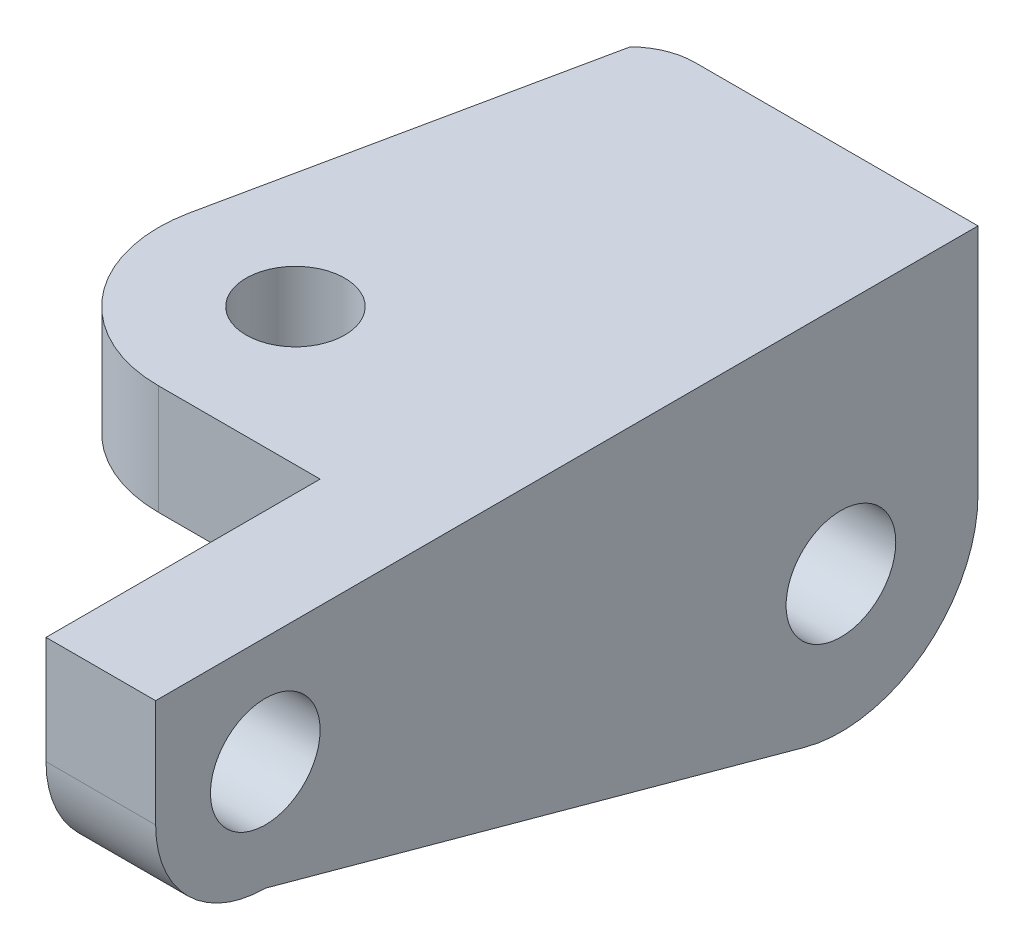
ISO-10303-21;
HEADER;
FILE_DESCRIPTION(('STEP AP214'),'2;1');
FILE_NAME('part.step','',(''),(''),'','','');
FILE_SCHEMA(('AUTOMOTIVE_DESIGN { 1 0 10303 214 1 1 1 1 }'));
ENDSEC;
DATA;
#1=APPLICATION_CONTEXT('core data for automotive mechanical design processes');
#2=APPLICATION_PROTOCOL_DEFINITION('international standard','automotive_design',2000,#1);
#3=PRODUCT_CONTEXT('',#1,'mechanical');
#4=PRODUCT('Part','Part','',(#3));
#5=PRODUCT_RELATED_PRODUCT_CATEGORY('part','',(#4));
#6=PRODUCT_DEFINITION_FORMATION('','',#4);
#7=PRODUCT_DEFINITION_CONTEXT('part definition',#1,'design');
#8=PRODUCT_DEFINITION('design','',#6,#7);
#9=PRODUCT_DEFINITION_SHAPE('','',#8);
#10=(LENGTH_UNIT() NAMED_UNIT(*) SI_UNIT(.MILLI.,.METRE.));
#11=(NAMED_UNIT(*) PLANE_ANGLE_UNIT() SI_UNIT($,.RADIAN.));
#12=(NAMED_UNIT(*) SI_UNIT($,.STERADIAN.) SOLID_ANGLE_UNIT());
#13=UNCERTAINTY_MEASURE_WITH_UNIT(LENGTH_MEASURE(1.E-05),#10,'distance_accuracy_value','');
#14=(GEOMETRIC_REPRESENTATION_CONTEXT(3) GLOBAL_UNCERTAINTY_ASSIGNED_CONTEXT((#13)) GLOBAL_UNIT_ASSIGNED_CONTEXT((#10,
#11,#12)) REPRESENTATION_CONTEXT('',''));
#15=CARTESIAN_POINT('',(0.,0.,0.));
#16=DIRECTION('',(0.,0.,1.));
#17=DIRECTION('',(1.,0.,0.));
#18=AXIS2_PLACEMENT_3D('',#15,#16,#17);
#19=CARTESIAN_POINT('',(0.,-19.63,-20.));
#20=DIRECTION('',(1.,0.,0.));
#21=DIRECTION('',(0.,0.,-1.));
#22=AXIS2_PLACEMENT_3D('',#19,#20,#21);
#23=PLANE('',#22);
#24=CARTESIAN_POINT('',(0.,-42.46,-125.));
#25=DIRECTION('',(1.,0.,0.));
#26=DIRECTION('',(0.,0.,-1.));
#27=AXIS2_PLACEMENT_3D('',#24,#25,#26);
#28=CIRCLE('',#27,10.);
#29=CARTESIAN_POINT('',(0.,-42.46,-135.));
#30=VERTEX_POINT('',#29);
#31=EDGE_CURVE('E173',#30,#30,#28,.T.);
#32=ORIENTED_EDGE('',*,*,#31,.T.);
#33=EDGE_LOOP('',(#32));
#34=FACE_BOUND('',#33,.T.);
#35=CARTESIAN_POINT('',(0.,-19.63,-20.));
#36=DIRECTION('',(1.,0.,0.));
#37=DIRECTION('',(0.,0.,-1.));
#38=AXIS2_PLACEMENT_3D('',#35,#36,#37);
#39=CIRCLE('',#38,10.);
#40=CARTESIAN_POINT('',(0.,-19.63,-30.));
#41=VERTEX_POINT('',#40);
#42=EDGE_CURVE('E167',#41,#41,#39,.T.);
#43=ORIENTED_EDGE('',*,*,#42,.T.);
#44=EDGE_LOOP('',(#43));
#45=FACE_BOUND('',#44,.T.);
#46=DIRECTION('',(0.,1.,0.));
#47=VECTOR('',#46,1.);
#48=CARTESIAN_POINT('',(0.,-20.,-50.));
#49=LINE('',#48,#47);
#50=CARTESIAN_POINT('',(0.,-20.,-50.));
#51=VERTEX_POINT('',#50);
#52=CARTESIAN_POINT('',(0.,0.,-50.));
#53=VERTEX_POINT('',#52);
#54=EDGE_CURVE('E176',#51,#53,#49,.T.);
#55=ORIENTED_EDGE('',*,*,#54,.F.);
#56=DIRECTION('',(0.,0.,-1.));
#57=VECTOR('',#56,1.);
#58=CARTESIAN_POINT('',(0.,-20.,-50.));
#59=LINE('',#58,#57);
#60=CARTESIAN_POINT('',(0.,-20.,-150.));
#61=VERTEX_POINT('',#60);
#62=EDGE_CURVE('E150',#51,#61,#59,.T.);
#63=ORIENTED_EDGE('',*,*,#62,.T.);
#64=DIRECTION('',(0.,1.,0.));
#65=VECTOR('',#64,1.);
#66=CARTESIAN_POINT('',(0.,-42.46,-150.));
#67=LINE('',#66,#65);
#68=CARTESIAN_POINT('',(0.,-42.46,-150.));
#69=VERTEX_POINT('',#68);
#70=EDGE_CURVE('E134',#69,#61,#67,.T.);
#71=ORIENTED_EDGE('',*,*,#70,.F.);
#72=CARTESIAN_POINT('',(0.,-42.46,-125.));
#73=DIRECTION('',(1.,0.,0.));
#74=DIRECTION('',(0.,0.,-1.));
#75=AXIS2_PLACEMENT_3D('',#72,#73,#74);
#76=CIRCLE('',#75,25.);
#77=CARTESIAN_POINT('',(0.,-66.5724458933428,-118.397731220208));
#78=VERTEX_POINT('',#77);
#79=EDGE_CURVE('E82',#78,#69,#76,.T.);
#80=ORIENTED_EDGE('',*,*,#79,.F.);
#81=DIRECTION('',(0.,-0.26409075119168,-0.964497835733712));
#82=VECTOR('',#81,1.);
#83=CARTESIAN_POINT('',(0.,-39.63,-20.));
#84=LINE('',#83,#82);
#85=CARTESIAN_POINT('',(0.,-39.63,-20.));
#86=VERTEX_POINT('',#85);
#87=EDGE_CURVE('E115',#86,#78,#84,.T.);
#88=ORIENTED_EDGE('',*,*,#87,.F.);
#89=CARTESIAN_POINT('',(0.,-19.63,-20.));
#90=DIRECTION('',(1.,0.,0.));
#91=DIRECTION('',(0.,0.,-1.));
#92=AXIS2_PLACEMENT_3D('',#89,#90,#91);
#93=CIRCLE('',#92,20.);
#94=CARTESIAN_POINT('',(0.,-19.63,0.));
#95=VERTEX_POINT('',#94);
#96=EDGE_CURVE('E130',#95,#86,#93,.T.);
#97=ORIENTED_EDGE('',*,*,#96,.F.);
#98=DIRECTION('',(0.,-1.,0.));
#99=VECTOR('',#98,1.);
#100=CARTESIAN_POINT('',(0.,0.,0.));
#101=LINE('',#100,#99);
#102=CARTESIAN_POINT('',(0.,0.,0.));
#103=VERTEX_POINT('',#102);
#104=EDGE_CURVE('E127',#103,#95,#101,.T.);
#105=ORIENTED_EDGE('',*,*,#104,.F.);
#106=DIRECTION('',(0.,0.,1.));
#107=VECTOR('',#106,1.);
#108=CARTESIAN_POINT('',(0.,0.,-150.));
#109=LINE('',#108,#107);
#110=EDGE_CURVE('E125',#53,#103,#109,.T.);
#111=ORIENTED_EDGE('',*,*,#110,.F.);
#112=EDGE_LOOP('',(#55,#63,#71,#80,#88,#97,#105,#111));
#113=FACE_BOUND('',#112,.T.);
#114=ADVANCED_FACE('F33',(#34,#45,#113),#23,.F.);
#115=CARTESIAN_POINT('',(20.,-19.63,-20.));
#116=DIRECTION('',(1.,0.,0.));
#117=DIRECTION('',(0.,0.,-1.));
#118=AXIS2_PLACEMENT_3D('',#115,#116,#117);
#119=PLANE('',#118);
#120=CARTESIAN_POINT('',(20.,-19.63,-20.));
#121=DIRECTION('',(1.,0.,0.));
#122=DIRECTION('',(0.,0.,-1.));
#123=AXIS2_PLACEMENT_3D('',#120,#121,#122);
#124=CIRCLE('',#123,10.);
#125=CARTESIAN_POINT('',(20.,-19.63,-30.));
#126=VERTEX_POINT('',#125);
#127=EDGE_CURVE('E128',#126,#126,#124,.T.);
#128=ORIENTED_EDGE('',*,*,#127,.F.);
#129=EDGE_LOOP('',(#128));
#130=FACE_BOUND('',#129,.T.);
#131=DIRECTION('',(0.,0.,1.));
#132=VECTOR('',#131,1.);
#133=CARTESIAN_POINT('',(20.,0.,-150.));
#134=LINE('',#133,#132);
#135=CARTESIAN_POINT('',(20.,0.,-150.));
#136=VERTEX_POINT('',#135);
#137=CARTESIAN_POINT('',(20.,0.,0.));
#138=VERTEX_POINT('',#137);
#139=EDGE_CURVE('E137',#136,#138,#134,.T.);
#140=ORIENTED_EDGE('',*,*,#139,.T.);
#141=DIRECTION('',(0.,-1.,0.));
#142=VECTOR('',#141,1.);
#143=CARTESIAN_POINT('',(20.,0.,0.));
#144=LINE('',#143,#142);
#145=CARTESIAN_POINT('',(20.,-19.63,0.));
#146=VERTEX_POINT('',#145);
#147=EDGE_CURVE('E90',#138,#146,#144,.T.);
#148=ORIENTED_EDGE('',*,*,#147,.T.);
#149=CARTESIAN_POINT('',(20.,-19.63,-20.));
#150=DIRECTION('',(1.,0.,0.));
#151=DIRECTION('',(0.,0.,-1.));
#152=AXIS2_PLACEMENT_3D('',#149,#150,#151);
#153=CIRCLE('',#152,20.);
#154=CARTESIAN_POINT('',(20.,-39.63,-20.));
#155=VERTEX_POINT('',#154);
#156=EDGE_CURVE('E107',#146,#155,#153,.T.);
#157=ORIENTED_EDGE('',*,*,#156,.T.);
#158=DIRECTION('',(0.,-0.26409075119168,-0.964497835733712));
#159=VECTOR('',#158,1.);
#160=CARTESIAN_POINT('',(20.,-39.63,-20.));
#161=LINE('',#160,#159);
#162=CARTESIAN_POINT('',(20.,-66.5724458933428,-118.397731220208));
#163=VERTEX_POINT('',#162);
#164=EDGE_CURVE('E100',#155,#163,#161,.T.);
#165=ORIENTED_EDGE('',*,*,#164,.T.);
#166=CARTESIAN_POINT('',(20.,-42.46,-125.));
#167=DIRECTION('',(1.,0.,0.));
#168=DIRECTION('',(0.,0.,-1.));
#169=AXIS2_PLACEMENT_3D('',#166,#167,#168);
#170=CIRCLE('',#169,25.);
#171=CARTESIAN_POINT('',(20.,-42.46,-150.));
#172=VERTEX_POINT('',#171);
#173=EDGE_CURVE('E105',#163,#172,#170,.T.);
#174=ORIENTED_EDGE('',*,*,#173,.T.);
#175=DIRECTION('',(0.,1.,0.));
#176=VECTOR('',#175,1.);
#177=CARTESIAN_POINT('',(20.,-42.46,-150.));
#178=LINE('',#177,#176);
#179=EDGE_CURVE('E57',#172,#136,#178,.T.);
#180=ORIENTED_EDGE('',*,*,#179,.T.);
#181=EDGE_LOOP('',(#140,#148,#157,#165,#174,#180));
#182=FACE_BOUND('',#181,.T.);
#183=CARTESIAN_POINT('',(20.,-42.46,-125.));
#184=DIRECTION('',(1.,0.,0.));
#185=DIRECTION('',(0.,0.,-1.));
#186=AXIS2_PLACEMENT_3D('',#183,#184,#185);
#187=CIRCLE('',#186,10.);
#188=CARTESIAN_POINT('',(20.,-42.46,-135.));
#189=VERTEX_POINT('',#188);
#190=EDGE_CURVE('E170',#189,#189,#187,.T.);
#191=ORIENTED_EDGE('',*,*,#190,.F.);
#192=EDGE_LOOP('',(#191));
#193=FACE_BOUND('',#192,.T.);
#194=ADVANCED_FACE('F102',(#130,#182,#193),#119,.T.);
#195=CARTESIAN_POINT('',(20.,0.,-150.));
#196=DIRECTION('',(0.,-1.,0.));
#197=DIRECTION('',(0.,0.,-1.));
#198=AXIS2_PLACEMENT_3D('',#195,#196,#197);
#199=PLANE('',#198);
#200=DIRECTION('',(-1.,0.,0.));
#201=VECTOR('',#200,1.);
#202=CARTESIAN_POINT('',(20.,0.,-150.));
#203=LINE('',#202,#201);
#204=CARTESIAN_POINT('',(-31.593900405197,0.,-150.));
#205=VERTEX_POINT('',#204);
#206=EDGE_CURVE('E121',#136,#205,#203,.T.);
#207=ORIENTED_EDGE('',*,*,#206,.T.);
#208=CARTESIAN_POINT('',(-31.593900405197,0.,-138.));
#209=DIRECTION('',(0.,1.,0.));
#210=DIRECTION('',(0.,0.,1.));
#211=AXIS2_PLACEMENT_3D('',#208,#209,#210);
#212=CIRCLE('',#211,12.);
#213=CARTESIAN_POINT('',(-40.,0.,-146.563731056161));
#214=VERTEX_POINT('',#213);
#215=EDGE_CURVE('E201',#205,#214,#212,.T.);
#216=ORIENTED_EDGE('',*,*,#215,.T.);
#217=DIRECTION('',(-0.205755971685466,0.,0.978603331343078));
#218=VECTOR('',#217,1.);
#219=CARTESIAN_POINT('',(-40.,0.,-146.563731056161));
#220=LINE('',#219,#218);
#221=CARTESIAN_POINT('',(-53.965083283577,0.,-80.1438992921366));
#222=VERTEX_POINT('',#221);
#223=EDGE_CURVE('E198',#214,#222,#220,.T.);
#224=ORIENTED_EDGE('',*,*,#223,.T.);
#225=CARTESIAN_POINT('',(-29.5,0.,-75.));
#226=DIRECTION('',(0.,1.,0.));
#227=DIRECTION('',(0.,0.,1.));
#228=AXIS2_PLACEMENT_3D('',#225,#226,#227);
#229=CIRCLE('',#228,25.);
#230=CARTESIAN_POINT('',(-29.5,0.,-50.));
#231=VERTEX_POINT('',#230);
#232=EDGE_CURVE('E195',#222,#231,#229,.T.);
#233=ORIENTED_EDGE('',*,*,#232,.T.);
#234=DIRECTION('',(1.,0.,0.));
#235=VECTOR('',#234,1.);
#236=CARTESIAN_POINT('',(-29.5,0.,-50.));
#237=LINE('',#236,#235);
#238=EDGE_CURVE('E192',#231,#53,#237,.T.);
#239=ORIENTED_EDGE('',*,*,#238,.T.);
#240=ORIENTED_EDGE('',*,*,#110,.T.);
#241=DIRECTION('',(-1.,0.,0.));
#242=VECTOR('',#241,1.);
#243=CARTESIAN_POINT('',(20.,0.,0.));
#244=LINE('',#243,#242);
#245=EDGE_CURVE('E11',#138,#103,#244,.T.);
#246=ORIENTED_EDGE('',*,*,#245,.F.);
#247=ORIENTED_EDGE('',*,*,#139,.F.);
#248=EDGE_LOOP('',(#207,#216,#224,#233,#239,#240,#246,#247));
#249=FACE_BOUND('',#248,.T.);
#250=CARTESIAN_POINT('',(-29.5,0.,-75.));
#251=DIRECTION('',(0.,1.,0.));
#252=DIRECTION('',(0.,0.,1.));
#253=AXIS2_PLACEMENT_3D('',#250,#251,#252);
#254=CIRCLE('',#253,9.);
#255=CARTESIAN_POINT('',(-29.5,0.,-66.));
#256=VERTEX_POINT('',#255);
#257=EDGE_CURVE('E217',#256,#256,#254,.T.);
#258=ORIENTED_EDGE('',*,*,#257,.F.);
#259=EDGE_LOOP('',(#258));
#260=FACE_BOUND('',#259,.T.);
#261=ADVANCED_FACE('F35',(#249,#260),#199,.F.);
#262=CARTESIAN_POINT('',(20.,0.,0.));
#263=DIRECTION('',(0.,0.,-1.));
#264=DIRECTION('',(0.,1.,0.));
#265=AXIS2_PLACEMENT_3D('',#262,#263,#264);
#266=PLANE('',#265);
#267=ORIENTED_EDGE('',*,*,#104,.T.);
#268=DIRECTION('',(-1.,0.,0.));
#269=VECTOR('',#268,1.);
#270=CARTESIAN_POINT('',(20.,-19.63,0.));
#271=LINE('',#270,#269);
#272=EDGE_CURVE('E41',#146,#95,#271,.T.);
#273=ORIENTED_EDGE('',*,*,#272,.F.);
#274=ORIENTED_EDGE('',*,*,#147,.F.);
#275=ORIENTED_EDGE('',*,*,#245,.T.);
#276=EDGE_LOOP('',(#267,#273,#274,#275));
#277=FACE_BOUND('',#276,.T.);
#278=ADVANCED_FACE('F231',(#277),#266,.F.);
#279=CARTESIAN_POINT('',(20.,-19.63,-20.));
#280=DIRECTION('',(-1.,0.,0.));
#281=DIRECTION('',(0.,0.,1.));
#282=AXIS2_PLACEMENT_3D('',#279,#280,#281);
#283=CYLINDRICAL_SURFACE('',#282,20.);
#284=ORIENTED_EDGE('',*,*,#96,.T.);
#285=DIRECTION('',(-1.,0.,0.));
#286=VECTOR('',#285,1.);
#287=CARTESIAN_POINT('',(20.,-39.63,-20.));
#288=LINE('',#287,#286);
#289=EDGE_CURVE('E116',#155,#86,#288,.T.);
#290=ORIENTED_EDGE('',*,*,#289,.F.);
#291=ORIENTED_EDGE('',*,*,#156,.F.);
#292=ORIENTED_EDGE('',*,*,#272,.T.);
#293=EDGE_LOOP('',(#284,#290,#291,#292));
#294=FACE_BOUND('',#293,.T.);
#295=ADVANCED_FACE('F144',(#294),#283,.T.);
#296=CARTESIAN_POINT('',(20.,-39.63,-20.));
#297=DIRECTION('',(0.,0.964497835733712,-0.26409075119168));
#298=DIRECTION('',(0.,0.26409075119168,0.964497835733712));
#299=AXIS2_PLACEMENT_3D('',#296,#297,#298);
#300=PLANE('',#299);
#301=ORIENTED_EDGE('',*,*,#87,.T.);
#302=DIRECTION('',(-1.,0.,0.));
#303=VECTOR('',#302,1.);
#304=CARTESIAN_POINT('',(20.,-66.5724458933428,-118.397731220208));
#305=LINE('',#304,#303);
#306=EDGE_CURVE('E112',#163,#78,#305,.T.);
#307=ORIENTED_EDGE('',*,*,#306,.F.);
#308=ORIENTED_EDGE('',*,*,#164,.F.);
#309=ORIENTED_EDGE('',*,*,#289,.T.);
#310=EDGE_LOOP('',(#301,#307,#308,#309));
#311=FACE_BOUND('',#310,.T.);
#312=ADVANCED_FACE('F113',(#311),#300,.F.);
#313=CARTESIAN_POINT('',(20.,-42.46,-125.));
#314=DIRECTION('',(-1.,0.,0.));
#315=DIRECTION('',(0.,0.,1.));
#316=AXIS2_PLACEMENT_3D('',#313,#314,#315);
#317=CYLINDRICAL_SURFACE('',#316,25.);
#318=ORIENTED_EDGE('',*,*,#79,.T.);
#319=DIRECTION('',(-1.,0.,0.));
#320=VECTOR('',#319,1.);
#321=CARTESIAN_POINT('',(20.,-42.46,-150.));
#322=LINE('',#321,#320);
#323=EDGE_CURVE('E117',#172,#69,#322,.T.);
#324=ORIENTED_EDGE('',*,*,#323,.F.);
#325=ORIENTED_EDGE('',*,*,#173,.F.);
#326=ORIENTED_EDGE('',*,*,#306,.T.);
#327=EDGE_LOOP('',(#318,#324,#325,#326));
#328=FACE_BOUND('',#327,.T.);
#329=ADVANCED_FACE('F119',(#328),#317,.T.);
#330=CARTESIAN_POINT('',(20.,-42.46,-150.));
#331=DIRECTION('',(0.,0.,1.));
#332=DIRECTION('',(1.,0.,0.));
#333=AXIS2_PLACEMENT_3D('',#330,#331,#332);
#334=PLANE('',#333);
#335=ORIENTED_EDGE('',*,*,#70,.T.);
#336=DIRECTION('',(-1.,0.,0.));
#337=VECTOR('',#336,1.);
#338=CARTESIAN_POINT('',(0.,-20.,-150.));
#339=LINE('',#338,#337);
#340=CARTESIAN_POINT('',(-31.593900405197,-20.,-150.));
#341=VERTEX_POINT('',#340);
#342=EDGE_CURVE('E48',#61,#341,#339,.T.);
#343=ORIENTED_EDGE('',*,*,#342,.T.);
#344=DIRECTION('',(0.,1.,0.));
#345=VECTOR('',#344,1.);
#346=CARTESIAN_POINT('',(-31.593900405197,-20.,-150.));
#347=LINE('',#346,#345);
#348=EDGE_CURVE('E158',#341,#205,#347,.T.);
#349=ORIENTED_EDGE('',*,*,#348,.T.);
#350=ORIENTED_EDGE('',*,*,#206,.F.);
#351=ORIENTED_EDGE('',*,*,#179,.F.);
#352=ORIENTED_EDGE('',*,*,#323,.T.);
#353=EDGE_LOOP('',(#335,#343,#349,#350,#351,#352));
#354=FACE_BOUND('',#353,.T.);
#355=ADVANCED_FACE('F152',(#354),#334,.F.);
#356=CARTESIAN_POINT('',(20.,-19.63,-20.));
#357=DIRECTION('',(-1.,0.,0.));
#358=DIRECTION('',(0.,0.,1.));
#359=AXIS2_PLACEMENT_3D('',#356,#357,#358);
#360=CYLINDRICAL_SURFACE('',#359,10.);
#361=ORIENTED_EDGE('',*,*,#127,.T.);
#362=EDGE_LOOP('',(#361));
#363=FACE_BOUND('',#362,.T.);
#364=ORIENTED_EDGE('',*,*,#42,.F.);
#365=EDGE_LOOP('',(#364));
#366=FACE_BOUND('',#365,.T.);
#367=ADVANCED_FACE('F248',(#363,#366),#360,.F.);
#368=CARTESIAN_POINT('',(20.,-42.46,-125.));
#369=DIRECTION('',(-1.,0.,0.));
#370=DIRECTION('',(0.,0.,1.));
#371=AXIS2_PLACEMENT_3D('',#368,#369,#370);
#372=CYLINDRICAL_SURFACE('',#371,10.);
#373=ORIENTED_EDGE('',*,*,#190,.T.);
#374=EDGE_LOOP('',(#373));
#375=FACE_BOUND('',#374,.T.);
#376=ORIENTED_EDGE('',*,*,#31,.F.);
#377=EDGE_LOOP('',(#376));
#378=FACE_BOUND('',#377,.T.);
#379=ADVANCED_FACE('F277',(#375,#378),#372,.F.);
#380=CARTESIAN_POINT('',(-29.5,-20.,-50.));
#381=DIRECTION('',(0.,0.,1.));
#382=DIRECTION('',(1.,0.,0.));
#383=AXIS2_PLACEMENT_3D('',#380,#381,#382);
#384=PLANE('',#383);
#385=ORIENTED_EDGE('',*,*,#238,.F.);
#386=DIRECTION('',(0.,1.,0.));
#387=VECTOR('',#386,1.);
#388=CARTESIAN_POINT('',(-29.5,-20.,-50.));
#389=LINE('',#388,#387);
#390=CARTESIAN_POINT('',(-29.5,-20.,-50.));
#391=VERTEX_POINT('',#390);
#392=EDGE_CURVE('E187',#391,#231,#389,.T.);
#393=ORIENTED_EDGE('',*,*,#392,.F.);
#394=DIRECTION('',(1.,0.,0.));
#395=VECTOR('',#394,1.);
#396=CARTESIAN_POINT('',(-29.5,-20.,-50.));
#397=LINE('',#396,#395);
#398=EDGE_CURVE('E181',#391,#51,#397,.T.);
#399=ORIENTED_EDGE('',*,*,#398,.T.);
#400=ORIENTED_EDGE('',*,*,#54,.T.);
#401=EDGE_LOOP('',(#385,#393,#399,#400));
#402=FACE_BOUND('',#401,.T.);
#403=ADVANCED_FACE('F284',(#402),#384,.T.);
#404=CARTESIAN_POINT('',(-29.5,-20.,-75.));
#405=DIRECTION('',(0.,1.,0.));
#406=DIRECTION('',(0.,0.,1.));
#407=AXIS2_PLACEMENT_3D('',#404,#405,#406);
#408=CYLINDRICAL_SURFACE('',#407,25.);
#409=ORIENTED_EDGE('',*,*,#232,.F.);
#410=DIRECTION('',(0.,1.,0.));
#411=VECTOR('',#410,1.);
#412=CARTESIAN_POINT('',(-53.965083283577,-20.,-80.1438992921366));
#413=LINE('',#412,#411);
#414=CARTESIAN_POINT('',(-53.965083283577,-20.,-80.1438992921366));
#415=VERTEX_POINT('',#414);
#416=EDGE_CURVE('E184',#415,#222,#413,.T.);
#417=ORIENTED_EDGE('',*,*,#416,.F.);
#418=CARTESIAN_POINT('',(-29.5,-20.,-75.));
#419=DIRECTION('',(0.,1.,0.));
#420=DIRECTION('',(0.,0.,1.));
#421=AXIS2_PLACEMENT_3D('',#418,#419,#420);
#422=CIRCLE('',#421,25.);
#423=EDGE_CURVE('E206',#415,#391,#422,.T.);
#424=ORIENTED_EDGE('',*,*,#423,.T.);
#425=ORIENTED_EDGE('',*,*,#392,.T.);
#426=EDGE_LOOP('',(#409,#417,#424,#425));
#427=FACE_BOUND('',#426,.T.);
#428=ADVANCED_FACE('F291',(#427),#408,.T.);
#429=CARTESIAN_POINT('',(-40.,-20.,-146.563731056161));
#430=DIRECTION('',(-0.978603331343078,0.,-0.205755971685465));
#431=DIRECTION('',(-0.205755971685465,0.,0.978603331343078));
#432=AXIS2_PLACEMENT_3D('',#429,#430,#431);
#433=PLANE('',#432);
#434=ORIENTED_EDGE('',*,*,#223,.F.);
#435=DIRECTION('',(0.,1.,0.));
#436=VECTOR('',#435,1.);
#437=CARTESIAN_POINT('',(-40.,-20.,-146.563731056161));
#438=LINE('',#437,#436);
#439=CARTESIAN_POINT('',(-40.,-20.,-146.563731056161));
#440=VERTEX_POINT('',#439);
#441=EDGE_CURVE('E180',#440,#214,#438,.T.);
#442=ORIENTED_EDGE('',*,*,#441,.F.);
#443=DIRECTION('',(-0.205755971685466,0.,0.978603331343078));
#444=VECTOR('',#443,1.);
#445=CARTESIAN_POINT('',(-40.,-20.,-146.563731056161));
#446=LINE('',#445,#444);
#447=EDGE_CURVE('E209',#440,#415,#446,.T.);
#448=ORIENTED_EDGE('',*,*,#447,.T.);
#449=ORIENTED_EDGE('',*,*,#416,.T.);
#450=EDGE_LOOP('',(#434,#442,#448,#449));
#451=FACE_BOUND('',#450,.T.);
#452=ADVANCED_FACE('F299',(#451),#433,.T.);
#453=CARTESIAN_POINT('',(-31.593900405197,-20.,-138.));
#454=DIRECTION('',(0.,1.,0.));
#455=DIRECTION('',(0.,0.,1.));
#456=AXIS2_PLACEMENT_3D('',#453,#454,#455);
#457=CYLINDRICAL_SURFACE('',#456,12.);
#458=ORIENTED_EDGE('',*,*,#215,.F.);
#459=ORIENTED_EDGE('',*,*,#348,.F.);
#460=CARTESIAN_POINT('',(-31.593900405197,-20.,-138.));
#461=DIRECTION('',(0.,1.,0.));
#462=DIRECTION('',(0.,0.,1.));
#463=AXIS2_PLACEMENT_3D('',#460,#461,#462);
#464=CIRCLE('',#463,12.);
#465=EDGE_CURVE('E212',#341,#440,#464,.T.);
#466=ORIENTED_EDGE('',*,*,#465,.T.);
#467=ORIENTED_EDGE('',*,*,#441,.T.);
#468=EDGE_LOOP('',(#458,#459,#466,#467));
#469=FACE_BOUND('',#468,.T.);
#470=ADVANCED_FACE('F307',(#469),#457,.T.);
#471=CARTESIAN_POINT('',(-31.593900405197,-20.,-138.));
#472=DIRECTION('',(0.,1.,0.));
#473=DIRECTION('',(0.,0.,1.));
#474=AXIS2_PLACEMENT_3D('',#471,#472,#473);
#475=PLANE('',#474);
#476=CARTESIAN_POINT('',(-29.5,-20.,-75.));
#477=DIRECTION('',(0.,1.,0.));
#478=DIRECTION('',(0.,0.,1.));
#479=AXIS2_PLACEMENT_3D('',#476,#477,#478);
#480=CIRCLE('',#479,9.);
#481=CARTESIAN_POINT('',(-29.5,-20.,-66.));
#482=VERTEX_POINT('',#481);
#483=EDGE_CURVE('E203',#482,#482,#480,.T.);
#484=ORIENTED_EDGE('',*,*,#483,.T.);
#485=EDGE_LOOP('',(#484));
#486=FACE_BOUND('',#485,.T.);
#487=ORIENTED_EDGE('',*,*,#62,.F.);
#488=ORIENTED_EDGE('',*,*,#398,.F.);
#489=ORIENTED_EDGE('',*,*,#423,.F.);
#490=ORIENTED_EDGE('',*,*,#447,.F.);
#491=ORIENTED_EDGE('',*,*,#465,.F.);
#492=ORIENTED_EDGE('',*,*,#342,.F.);
#493=EDGE_LOOP('',(#487,#488,#489,#490,#491,#492));
#494=FACE_BOUND('',#493,.T.);
#495=ADVANCED_FACE('F223',(#486,#494),#475,.F.);
#496=CARTESIAN_POINT('',(-29.5,-20.,-75.));
#497=DIRECTION('',(0.,1.,0.));
#498=DIRECTION('',(0.,0.,1.));
#499=AXIS2_PLACEMENT_3D('',#496,#497,#498);
#500=CYLINDRICAL_SURFACE('',#499,9.);
#501=ORIENTED_EDGE('',*,*,#483,.F.);
#502=EDGE_LOOP('',(#501));
#503=FACE_BOUND('',#502,.T.);
#504=ORIENTED_EDGE('',*,*,#257,.T.);
#505=EDGE_LOOP('',(#504));
#506=FACE_BOUND('',#505,.T.);
#507=ADVANCED_FACE('F225',(#503,#506),#500,.F.);
#508=CLOSED_SHELL('',(#114,#194,#261,#278,#295,#312,#329,#355,#367,#379,#403,#428,#452,#470,
#495,#507));
#509=MANIFOLD_SOLID_BREP('B2',#508);
#510=ADVANCED_BREP_SHAPE_REPRESENTATION('',(#18,#509),#14);
#511=SHAPE_DEFINITION_REPRESENTATION(#9,#510);
ENDSEC;
END-ISO-10303-21;
